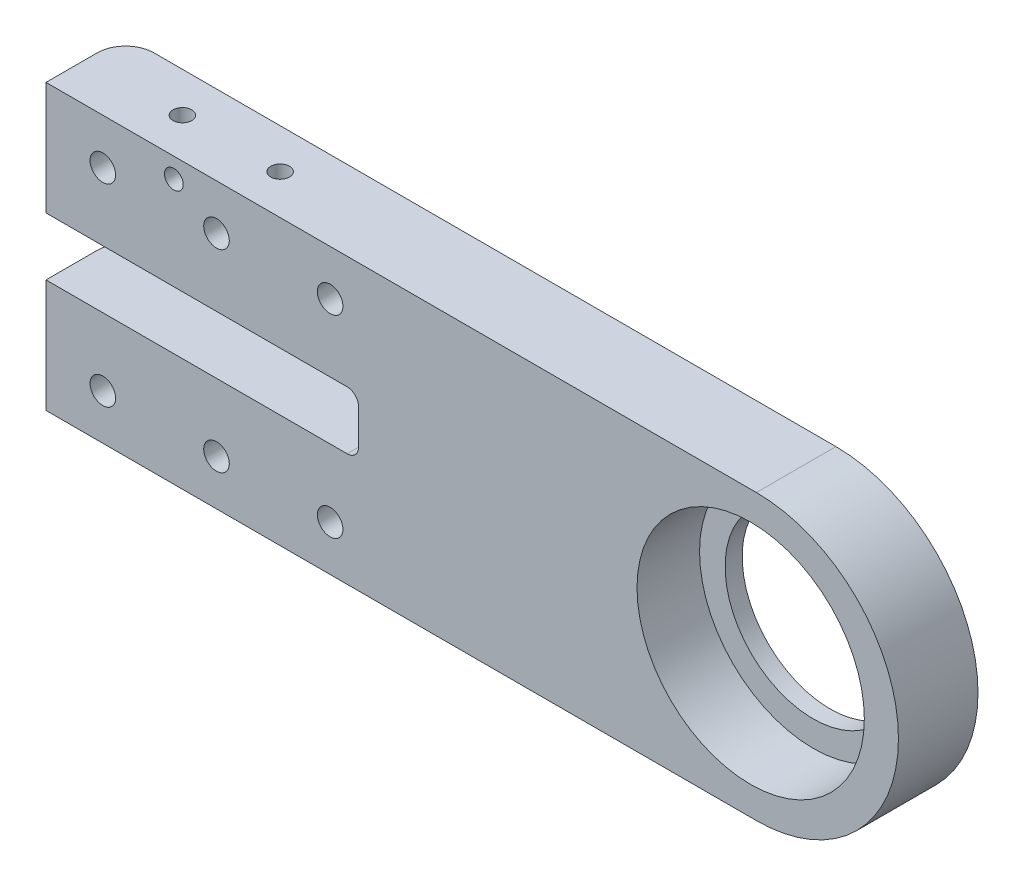
ISO-10303-21;
HEADER;
FILE_DESCRIPTION(('STEP AP214'),'2;1');
FILE_NAME('part.step','',(''),(''),'','','');
FILE_SCHEMA(('AUTOMOTIVE_DESIGN { 1 0 10303 214 1 1 1 1 }'));
ENDSEC;
DATA;
#1=APPLICATION_CONTEXT('core data for automotive mechanical design processes');
#2=APPLICATION_PROTOCOL_DEFINITION('international standard','automotive_design',2000,#1);
#3=PRODUCT_CONTEXT('',#1,'mechanical');
#4=PRODUCT('Part','Part','',(#3));
#5=PRODUCT_RELATED_PRODUCT_CATEGORY('part','',(#4));
#6=PRODUCT_DEFINITION_FORMATION('','',#4);
#7=PRODUCT_DEFINITION_CONTEXT('part definition',#1,'design');
#8=PRODUCT_DEFINITION('design','',#6,#7);
#9=PRODUCT_DEFINITION_SHAPE('','',#8);
#10=(LENGTH_UNIT() NAMED_UNIT(*) SI_UNIT(.MILLI.,.METRE.));
#11=(NAMED_UNIT(*) PLANE_ANGLE_UNIT() SI_UNIT($,.RADIAN.));
#12=(NAMED_UNIT(*) SI_UNIT($,.STERADIAN.) SOLID_ANGLE_UNIT());
#13=UNCERTAINTY_MEASURE_WITH_UNIT(LENGTH_MEASURE(1.E-05),#10,'distance_accuracy_value','');
#14=(GEOMETRIC_REPRESENTATION_CONTEXT(3) GLOBAL_UNCERTAINTY_ASSIGNED_CONTEXT((#13)) GLOBAL_UNIT_ASSIGNED_CONTEXT((#10,
#11,#12)) REPRESENTATION_CONTEXT('',''));
#15=CARTESIAN_POINT('',(0.,0.,0.));
#16=DIRECTION('',(0.,0.,1.));
#17=DIRECTION('',(1.,0.,0.));
#18=AXIS2_PLACEMENT_3D('',#15,#16,#17);
#19=CARTESIAN_POINT('',(0.,-50.,14.));
#20=DIRECTION('',(-1.,0.,0.));
#21=DIRECTION('',(0.,-1.,0.));
#22=AXIS2_PLACEMENT_3D('',#19,#20,#21);
#23=PLANE('',#22);
#24=DIRECTION('',(0.,0.,-1.));
#25=VECTOR('',#24,1.);
#26=CARTESIAN_POINT('',(0.,0.,14.));
#27=LINE('',#26,#25);
#28=CARTESIAN_POINT('',(0.,0.,14.));
#29=VERTEX_POINT('',#28);
#30=CARTESIAN_POINT('',(0.,0.,5.));
#31=VERTEX_POINT('',#30);
#32=EDGE_CURVE('E186',#29,#31,#27,.T.);
#33=ORIENTED_EDGE('',*,*,#32,.T.);
#34=DIRECTION('',(0.,1.,0.));
#35=VECTOR('',#34,1.);
#36=CARTESIAN_POINT('',(0.,-50.,5.));
#37=LINE('',#36,#35);
#38=CARTESIAN_POINT('',(0.,-19.8999999994651,5.));
#39=VERTEX_POINT('',#38);
#40=EDGE_CURVE('E45',#31,#39,#37,.F.);
#41=ORIENTED_EDGE('',*,*,#40,.T.);
#42=DIRECTION('',(0.,0.,1.));
#43=VECTOR('',#42,1.);
#44=CARTESIAN_POINT('',(0.,-19.8999999994651,0.));
#45=LINE('',#44,#43);
#46=CARTESIAN_POINT('',(0.,-19.8999999994651,14.));
#47=VERTEX_POINT('',#46);
#48=EDGE_CURVE('E137',#39,#47,#45,.T.);
#49=ORIENTED_EDGE('',*,*,#48,.T.);
#50=DIRECTION('',(0.,1.,0.));
#51=VECTOR('',#50,1.);
#52=CARTESIAN_POINT('',(0.,-50.,14.));
#53=LINE('',#52,#51);
#54=EDGE_CURVE('E158',#47,#29,#53,.T.);
#55=ORIENTED_EDGE('',*,*,#54,.T.);
#56=EDGE_LOOP('',(#33,#41,#49,#55));
#57=FACE_BOUND('',#56,.T.);
#58=ADVANCED_FACE('F36',(#57),#23,.T.);
#59=CARTESIAN_POINT('',(125.,-25.,14.));
#60=DIRECTION('',(0.,0.,-1.));
#61=DIRECTION('',(-1.,0.,0.));
#62=AXIS2_PLACEMENT_3D('',#59,#60,#61);
#63=CYLINDRICAL_SURFACE('',#62,25.);
#64=CARTESIAN_POINT('',(125.,-25.,0.));
#65=DIRECTION('',(0.,0.,-1.));
#66=DIRECTION('',(-1.,0.,0.));
#67=AXIS2_PLACEMENT_3D('',#64,#65,#66);
#68=CIRCLE('',#67,25.);
#69=CARTESIAN_POINT('',(125.,0.,0.));
#70=VERTEX_POINT('',#69);
#71=CARTESIAN_POINT('',(125.,-50.,0.));
#72=VERTEX_POINT('',#71);
#73=EDGE_CURVE('E170',#70,#72,#68,.T.);
#74=ORIENTED_EDGE('',*,*,#73,.F.);
#75=DIRECTION('',(0.,0.,-1.));
#76=VECTOR('',#75,1.);
#77=CARTESIAN_POINT('',(125.,0.,14.));
#78=LINE('',#77,#76);
#79=CARTESIAN_POINT('',(125.,0.,14.));
#80=VERTEX_POINT('',#79);
#81=EDGE_CURVE('E181',#80,#70,#78,.T.);
#82=ORIENTED_EDGE('',*,*,#81,.F.);
#83=CARTESIAN_POINT('',(125.,-25.,14.));
#84=DIRECTION('',(0.,0.,-1.));
#85=DIRECTION('',(-1.,0.,0.));
#86=AXIS2_PLACEMENT_3D('',#83,#84,#85);
#87=CIRCLE('',#86,25.);
#88=CARTESIAN_POINT('',(125.,-50.,14.));
#89=VERTEX_POINT('',#88);
#90=EDGE_CURVE('E180',#80,#89,#87,.T.);
#91=ORIENTED_EDGE('',*,*,#90,.T.);
#92=DIRECTION('',(0.,0.,-1.));
#93=VECTOR('',#92,1.);
#94=CARTESIAN_POINT('',(125.,-50.,14.));
#95=LINE('',#94,#93);
#96=EDGE_CURVE('E163',#89,#72,#95,.T.);
#97=ORIENTED_EDGE('',*,*,#96,.T.);
#98=EDGE_LOOP('',(#74,#82,#91,#97));
#99=FACE_BOUND('',#98,.T.);
#100=ADVANCED_FACE('F390',(#99),#63,.T.);
#101=CARTESIAN_POINT('',(0.,0.,14.));
#102=DIRECTION('',(0.,1.,0.));
#103=DIRECTION('',(0.,0.,1.));
#104=AXIS2_PLACEMENT_3D('',#101,#102,#103);
#105=PLANE('',#104);
#106=CARTESIAN_POINT('',(17.,0.,7.00000000000001));
#107=DIRECTION('',(0.,1.,0.));
#108=DIRECTION('',(0.,0.,1.));
#109=AXIS2_PLACEMENT_3D('',#106,#107,#108);
#110=CIRCLE('',#109,1.64999999999998);
#111=CARTESIAN_POINT('',(17.,0.,8.64999999999999));
#112=VERTEX_POINT('',#111);
#113=EDGE_CURVE('E295',#112,#112,#110,.T.);
#114=ORIENTED_EDGE('',*,*,#113,.F.);
#115=EDGE_LOOP('',(#114));
#116=FACE_BOUND('',#115,.T.);
#117=CARTESIAN_POINT('',(34.2,0.,7.00000000000001));
#118=DIRECTION('',(0.,1.,0.));
#119=DIRECTION('',(0.,0.,1.));
#120=AXIS2_PLACEMENT_3D('',#117,#118,#119);
#121=CIRCLE('',#120,1.64999999999998);
#122=CARTESIAN_POINT('',(34.2,0.,8.64999999999999));
#123=VERTEX_POINT('',#122);
#124=EDGE_CURVE('E294',#123,#123,#121,.T.);
#125=ORIENTED_EDGE('',*,*,#124,.F.);
#126=EDGE_LOOP('',(#125));
#127=FACE_BOUND('',#126,.T.);
#128=DIRECTION('',(1.,0.,0.));
#129=VECTOR('',#128,1.);
#130=CARTESIAN_POINT('',(0.,0.,0.));
#131=LINE('',#130,#129);
#132=CARTESIAN_POINT('',(5.,0.,0.));
#133=VERTEX_POINT('',#132);
#134=EDGE_CURVE('E178',#133,#70,#131,.T.);
#135=ORIENTED_EDGE('',*,*,#134,.F.);
#136=CARTESIAN_POINT('',(5.,0.,5.));
#137=DIRECTION('',(0.,1.,0.));
#138=DIRECTION('',(0.,0.,1.));
#139=AXIS2_PLACEMENT_3D('',#136,#137,#138);
#140=CIRCLE('',#139,5.);
#141=EDGE_CURVE('E59',#133,#31,#140,.T.);
#142=ORIENTED_EDGE('',*,*,#141,.T.);
#143=ORIENTED_EDGE('',*,*,#32,.F.);
#144=DIRECTION('',(1.,0.,0.));
#145=VECTOR('',#144,1.);
#146=CARTESIAN_POINT('',(0.,0.,14.));
#147=LINE('',#146,#145);
#148=EDGE_CURVE('E157',#29,#80,#147,.T.);
#149=ORIENTED_EDGE('',*,*,#148,.T.);
#150=ORIENTED_EDGE('',*,*,#81,.T.);
#151=EDGE_LOOP('',(#135,#142,#143,#149,#150));
#152=FACE_BOUND('',#151,.T.);
#153=ADVANCED_FACE('F395',(#116,#127,#152),#105,.T.);
#154=DIRECTION('',(0.,0.,1.));
#155=VECTOR('',#154,1.);
#156=CARTESIAN_POINT('',(0.,-30.0999999994651,0.));
#157=LINE('',#156,#155);
#158=CARTESIAN_POINT('',(0.,-30.0999999994651,5.));
#159=VERTEX_POINT('',#158);
#160=CARTESIAN_POINT('',(0.,-30.0999999994651,14.));
#161=VERTEX_POINT('',#160);
#162=EDGE_CURVE('E125',#159,#161,#157,.T.);
#163=ORIENTED_EDGE('',*,*,#162,.F.);
#164=DIRECTION('',(0.,1.,0.));
#165=VECTOR('',#164,1.);
#166=CARTESIAN_POINT('',(0.,-50.,5.));
#167=LINE('',#166,#165);
#168=CARTESIAN_POINT('',(0.,-50.,5.));
#169=VERTEX_POINT('',#168);
#170=EDGE_CURVE('E275',#159,#169,#167,.F.);
#171=ORIENTED_EDGE('',*,*,#170,.T.);
#172=DIRECTION('',(0.,0.,-1.));
#173=VECTOR('',#172,1.);
#174=CARTESIAN_POINT('',(0.,-50.,14.));
#175=LINE('',#174,#173);
#176=CARTESIAN_POINT('',(0.,-50.,14.));
#177=VERTEX_POINT('',#176);
#178=EDGE_CURVE('E155',#177,#169,#175,.T.);
#179=ORIENTED_EDGE('',*,*,#178,.F.);
#180=EDGE_CURVE('E145',#177,#161,#53,.T.);
#181=ORIENTED_EDGE('',*,*,#180,.T.);
#182=EDGE_LOOP('',(#163,#171,#179,#181));
#183=FACE_BOUND('',#182,.T.);
#184=ADVANCED_FACE('F153',(#183),#23,.T.);
#185=CARTESIAN_POINT('',(125.,-50.,14.));
#186=DIRECTION('',(0.,-1.,0.));
#187=DIRECTION('',(0.,0.,-1.));
#188=AXIS2_PLACEMENT_3D('',#185,#186,#187);
#189=PLANE('',#188);
#190=ORIENTED_EDGE('',*,*,#178,.T.);
#191=CARTESIAN_POINT('',(5.00000000000001,-50.,5.));
#192=DIRECTION('',(0.,-1.,0.));
#193=DIRECTION('',(0.,0.,-1.));
#194=AXIS2_PLACEMENT_3D('',#191,#192,#193);
#195=CIRCLE('',#194,5.);
#196=CARTESIAN_POINT('',(5.,-50.,0.));
#197=VERTEX_POINT('',#196);
#198=EDGE_CURVE('E278',#169,#197,#195,.T.);
#199=ORIENTED_EDGE('',*,*,#198,.T.);
#200=DIRECTION('',(-1.,0.,0.));
#201=VECTOR('',#200,1.);
#202=CARTESIAN_POINT('',(125.,-50.,0.));
#203=LINE('',#202,#201);
#204=EDGE_CURVE('E174',#72,#197,#203,.T.);
#205=ORIENTED_EDGE('',*,*,#204,.F.);
#206=ORIENTED_EDGE('',*,*,#96,.F.);
#207=DIRECTION('',(-1.,0.,0.));
#208=VECTOR('',#207,1.);
#209=CARTESIAN_POINT('',(125.,-50.,14.));
#210=LINE('',#209,#208);
#211=EDGE_CURVE('E166',#89,#177,#210,.T.);
#212=ORIENTED_EDGE('',*,*,#211,.T.);
#213=EDGE_LOOP('',(#190,#199,#205,#206,#212));
#214=FACE_BOUND('',#213,.T.);
#215=ADVANCED_FACE('F401',(#214),#189,.T.);
#216=CARTESIAN_POINT('',(125.,-25.,14.));
#217=DIRECTION('',(0.,0.,-1.));
#218=DIRECTION('',(-1.,0.,0.));
#219=AXIS2_PLACEMENT_3D('',#216,#217,#218);
#220=PLANE('',#219);
#221=CARTESIAN_POINT('',(123.999999994871,-24.9999999994651,14.));
#222=DIRECTION('',(0.,0.,1.));
#223=DIRECTION('',(1.,0.,0.));
#224=AXIS2_PLACEMENT_3D('',#221,#222,#223);
#225=CIRCLE('',#224,20.0000000051291);
#226=CARTESIAN_POINT('',(144.,-24.9999999994651,14.));
#227=VERTEX_POINT('',#226);
#228=EDGE_CURVE('E306',#227,#227,#225,.T.);
#229=ORIENTED_EDGE('',*,*,#228,.F.);
#230=EDGE_LOOP('',(#229));
#231=FACE_BOUND('',#230,.T.);
#232=CARTESIAN_POINT('',(22.5,-3.5,14.));
#233=DIRECTION('',(0.,0.,1.));
#234=DIRECTION('',(1.,0.,0.));
#235=AXIS2_PLACEMENT_3D('',#232,#233,#234);
#236=CIRCLE('',#235,1.64999999999998);
#237=CARTESIAN_POINT('',(24.15,-3.5,14.));
#238=VERTEX_POINT('',#237);
#239=EDGE_CURVE('E285',#238,#238,#236,.T.);
#240=ORIENTED_EDGE('',*,*,#239,.F.);
#241=EDGE_LOOP('',(#240));
#242=FACE_BOUND('',#241,.T.);
#243=CARTESIAN_POINT('',(10.,-8.,14.));
#244=DIRECTION('',(0.,0.,-1.));
#245=DIRECTION('',(-1.,0.,0.));
#246=AXIS2_PLACEMENT_3D('',#243,#244,#245);
#247=CIRCLE('',#246,2.24999999999997);
#248=CARTESIAN_POINT('',(7.75000000000003,-8.,14.));
#249=VERTEX_POINT('',#248);
#250=EDGE_CURVE('E312',#249,#249,#247,.T.);
#251=ORIENTED_EDGE('',*,*,#250,.T.);
#252=EDGE_LOOP('',(#251));
#253=FACE_BOUND('',#252,.T.);
#254=CARTESIAN_POINT('',(9.99999999999998,-42.,14.));
#255=DIRECTION('',(0.,0.,-1.));
#256=DIRECTION('',(-1.,0.,0.));
#257=AXIS2_PLACEMENT_3D('',#254,#255,#256);
#258=CIRCLE('',#257,2.24999999999997);
#259=CARTESIAN_POINT('',(7.75000000000002,-42.,14.));
#260=VERTEX_POINT('',#259);
#261=EDGE_CURVE('E325',#260,#260,#258,.T.);
#262=ORIENTED_EDGE('',*,*,#261,.T.);
#263=EDGE_LOOP('',(#262));
#264=FACE_BOUND('',#263,.T.);
#265=CARTESIAN_POINT('',(30.,-42.,14.));
#266=DIRECTION('',(0.,0.,-1.));
#267=DIRECTION('',(-1.,0.,0.));
#268=AXIS2_PLACEMENT_3D('',#265,#266,#267);
#269=CIRCLE('',#268,2.24999999999997);
#270=CARTESIAN_POINT('',(27.75,-42.,14.));
#271=VERTEX_POINT('',#270);
#272=EDGE_CURVE('E301',#271,#271,#269,.T.);
#273=ORIENTED_EDGE('',*,*,#272,.T.);
#274=EDGE_LOOP('',(#273));
#275=FACE_BOUND('',#274,.T.);
#276=CARTESIAN_POINT('',(30.,-8.,14.));
#277=DIRECTION('',(0.,0.,-1.));
#278=DIRECTION('',(-1.,0.,0.));
#279=AXIS2_PLACEMENT_3D('',#276,#277,#278);
#280=CIRCLE('',#279,2.24999999999996);
#281=CARTESIAN_POINT('',(27.75,-8.,14.));
#282=VERTEX_POINT('',#281);
#283=EDGE_CURVE('E297',#282,#282,#280,.T.);
#284=ORIENTED_EDGE('',*,*,#283,.T.);
#285=EDGE_LOOP('',(#284));
#286=FACE_BOUND('',#285,.T.);
#287=CARTESIAN_POINT('',(50.,-8.00000000000001,14.));
#288=DIRECTION('',(0.,0.,-1.));
#289=DIRECTION('',(-1.,0.,0.));
#290=AXIS2_PLACEMENT_3D('',#287,#288,#289);
#291=CIRCLE('',#290,2.24999999999997);
#292=CARTESIAN_POINT('',(47.75,-8.00000000000001,14.));
#293=VERTEX_POINT('',#292);
#294=EDGE_CURVE('E300',#293,#293,#291,.T.);
#295=ORIENTED_EDGE('',*,*,#294,.T.);
#296=EDGE_LOOP('',(#295));
#297=FACE_BOUND('',#296,.T.);
#298=CARTESIAN_POINT('',(50.,-42.,14.));
#299=DIRECTION('',(0.,0.,-1.));
#300=DIRECTION('',(-1.,0.,0.));
#301=AXIS2_PLACEMENT_3D('',#298,#299,#300);
#302=CIRCLE('',#301,2.24999999999997);
#303=CARTESIAN_POINT('',(47.75,-42.,14.));
#304=VERTEX_POINT('',#303);
#305=EDGE_CURVE('E151',#304,#304,#302,.T.);
#306=ORIENTED_EDGE('',*,*,#305,.T.);
#307=EDGE_LOOP('',(#306));
#308=FACE_BOUND('',#307,.T.);
#309=ORIENTED_EDGE('',*,*,#54,.F.);
#310=DIRECTION('',(-1.,0.,0.));
#311=VECTOR('',#310,1.);
#312=CARTESIAN_POINT('',(55.,-19.8999999994651,14.));
#313=LINE('',#312,#311);
#314=CARTESIAN_POINT('',(53.,-19.8999999994651,14.));
#315=VERTEX_POINT('',#314);
#316=EDGE_CURVE('E316',#315,#47,#313,.T.);
#317=ORIENTED_EDGE('',*,*,#316,.F.);
#318=CARTESIAN_POINT('',(53.,-21.8999999994651,14.));
#319=DIRECTION('',(0.,0.,-1.));
#320=DIRECTION('',(-1.,0.,0.));
#321=AXIS2_PLACEMENT_3D('',#318,#319,#320);
#322=CIRCLE('',#321,2.);
#323=CARTESIAN_POINT('',(55.,-21.8999999994651,14.));
#324=VERTEX_POINT('',#323);
#325=EDGE_CURVE('E254',#315,#324,#322,.T.);
#326=ORIENTED_EDGE('',*,*,#325,.T.);
#327=DIRECTION('',(0.,1.,0.));
#328=VECTOR('',#327,1.);
#329=CARTESIAN_POINT('',(55.,-30.0999999994651,14.));
#330=LINE('',#329,#328);
#331=CARTESIAN_POINT('',(55.,-28.0999999994651,14.));
#332=VERTEX_POINT('',#331);
#333=EDGE_CURVE('E150',#332,#324,#330,.T.);
#334=ORIENTED_EDGE('',*,*,#333,.F.);
#335=CARTESIAN_POINT('',(53.,-28.0999999994651,14.));
#336=DIRECTION('',(0.,0.,-1.));
#337=DIRECTION('',(-1.,0.,0.));
#338=AXIS2_PLACEMENT_3D('',#335,#336,#337);
#339=CIRCLE('',#338,2.);
#340=CARTESIAN_POINT('',(53.,-30.0999999994651,14.));
#341=VERTEX_POINT('',#340);
#342=EDGE_CURVE('E148',#332,#341,#339,.T.);
#343=ORIENTED_EDGE('',*,*,#342,.T.);
#344=DIRECTION('',(1.,0.,0.));
#345=VECTOR('',#344,1.);
#346=CARTESIAN_POINT('',(0.,-30.0999999994651,14.));
#347=LINE('',#346,#345);
#348=EDGE_CURVE('E130',#161,#341,#347,.T.);
#349=ORIENTED_EDGE('',*,*,#348,.F.);
#350=ORIENTED_EDGE('',*,*,#180,.F.);
#351=ORIENTED_EDGE('',*,*,#211,.F.);
#352=ORIENTED_EDGE('',*,*,#90,.F.);
#353=ORIENTED_EDGE('',*,*,#148,.F.);
#354=EDGE_LOOP('',(#309,#317,#326,#334,#343,#349,#350,#351,#352,#353));
#355=FACE_BOUND('',#354,.T.);
#356=ADVANCED_FACE('F143',(#231,#242,#253,#264,#275,#286,#297,#308,#355),#220,.F.);
#357=CARTESIAN_POINT('',(125.,-25.,0.));
#358=DIRECTION('',(0.,0.,-1.));
#359=DIRECTION('',(-1.,0.,0.));
#360=AXIS2_PLACEMENT_3D('',#357,#358,#359);
#361=PLANE('',#360);
#362=CARTESIAN_POINT('',(30.,-42.,0.));
#363=DIRECTION('',(0.,0.,-1.));
#364=DIRECTION('',(-1.,0.,0.));
#365=AXIS2_PLACEMENT_3D('',#362,#363,#364);
#366=CIRCLE('',#365,4.70000000001612);
#367=CARTESIAN_POINT('',(25.2999999999839,-42.,0.));
#368=VERTEX_POINT('',#367);
#369=EDGE_CURVE('E216',#368,#368,#366,.F.);
#370=ORIENTED_EDGE('',*,*,#369,.T.);
#371=EDGE_LOOP('',(#370));
#372=FACE_BOUND('',#371,.T.);
#373=CARTESIAN_POINT('',(9.99999999999998,-42.,0.));
#374=DIRECTION('',(0.,0.,-1.));
#375=DIRECTION('',(-1.,0.,0.));
#376=AXIS2_PLACEMENT_3D('',#373,#374,#375);
#377=CIRCLE('',#376,4.70000000001608);
#378=CARTESIAN_POINT('',(5.2999999999839,-42.,0.));
#379=VERTEX_POINT('',#378);
#380=EDGE_CURVE('E212',#379,#379,#377,.F.);
#381=ORIENTED_EDGE('',*,*,#380,.T.);
#382=EDGE_LOOP('',(#381));
#383=FACE_BOUND('',#382,.T.);
#384=CARTESIAN_POINT('',(50.,-42.,0.));
#385=DIRECTION('',(0.,0.,-1.));
#386=DIRECTION('',(-1.,0.,0.));
#387=AXIS2_PLACEMENT_3D('',#384,#385,#386);
#388=CIRCLE('',#387,4.70000000001608);
#389=CARTESIAN_POINT('',(45.2999999999839,-42.,0.));
#390=VERTEX_POINT('',#389);
#391=EDGE_CURVE('E208',#390,#390,#388,.F.);
#392=ORIENTED_EDGE('',*,*,#391,.T.);
#393=EDGE_LOOP('',(#392));
#394=FACE_BOUND('',#393,.T.);
#395=CARTESIAN_POINT('',(30.,-8.,0.));
#396=DIRECTION('',(0.,0.,-1.));
#397=DIRECTION('',(-1.,0.,0.));
#398=AXIS2_PLACEMENT_3D('',#395,#396,#397);
#399=CIRCLE('',#398,4.70000000001607);
#400=CARTESIAN_POINT('',(25.2999999999839,-8.,0.));
#401=VERTEX_POINT('',#400);
#402=EDGE_CURVE('E204',#401,#401,#399,.F.);
#403=ORIENTED_EDGE('',*,*,#402,.T.);
#404=EDGE_LOOP('',(#403));
#405=FACE_BOUND('',#404,.T.);
#406=CARTESIAN_POINT('',(10.,-8.,0.));
#407=DIRECTION('',(0.,0.,-1.));
#408=DIRECTION('',(-1.,0.,0.));
#409=AXIS2_PLACEMENT_3D('',#406,#407,#408);
#410=CIRCLE('',#409,4.70000000001612);
#411=CARTESIAN_POINT('',(5.29999999998388,-8.,0.));
#412=VERTEX_POINT('',#411);
#413=EDGE_CURVE('E200',#412,#412,#410,.F.);
#414=ORIENTED_EDGE('',*,*,#413,.T.);
#415=EDGE_LOOP('',(#414));
#416=FACE_BOUND('',#415,.T.);
#417=CARTESIAN_POINT('',(50.,-8.00000000000001,0.));
#418=DIRECTION('',(0.,0.,-1.));
#419=DIRECTION('',(-1.,0.,0.));
#420=AXIS2_PLACEMENT_3D('',#417,#418,#419);
#421=CIRCLE('',#420,4.70000000001608);
#422=CARTESIAN_POINT('',(45.2999999999839,-8.00000000000001,0.));
#423=VERTEX_POINT('',#422);
#424=EDGE_CURVE('E196',#423,#423,#421,.F.);
#425=ORIENTED_EDGE('',*,*,#424,.T.);
#426=EDGE_LOOP('',(#425));
#427=FACE_BOUND('',#426,.T.);
#428=CARTESIAN_POINT('',(123.999999994871,-24.9999999994651,0.));
#429=DIRECTION('',(0.,0.,1.));
#430=DIRECTION('',(1.,0.,0.));
#431=AXIS2_PLACEMENT_3D('',#428,#429,#430);
#432=CIRCLE('',#431,15.500000004746);
#433=CARTESIAN_POINT('',(139.499999999617,-24.9999999994651,0.));
#434=VERTEX_POINT('',#433);
#435=EDGE_CURVE('E341',#434,#434,#432,.T.);
#436=ORIENTED_EDGE('',*,*,#435,.T.);
#437=EDGE_LOOP('',(#436));
#438=FACE_BOUND('',#437,.T.);
#439=CARTESIAN_POINT('',(22.5,-3.5,0.));
#440=DIRECTION('',(0.,0.,1.));
#441=DIRECTION('',(1.,0.,0.));
#442=AXIS2_PLACEMENT_3D('',#439,#440,#441);
#443=CIRCLE('',#442,1.64999999999998);
#444=CARTESIAN_POINT('',(24.15,-3.5,0.));
#445=VERTEX_POINT('',#444);
#446=EDGE_CURVE('E287',#445,#445,#443,.T.);
#447=ORIENTED_EDGE('',*,*,#446,.T.);
#448=EDGE_LOOP('',(#447));
#449=FACE_BOUND('',#448,.T.);
#450=ORIENTED_EDGE('',*,*,#204,.T.);
#451=DIRECTION('',(0.,1.,0.));
#452=VECTOR('',#451,1.);
#453=CARTESIAN_POINT('',(5.,-25.,0.));
#454=LINE('',#453,#452);
#455=CARTESIAN_POINT('',(5.,-30.0999999994651,0.));
#456=VERTEX_POINT('',#455);
#457=EDGE_CURVE('E269',#197,#456,#454,.T.);
#458=ORIENTED_EDGE('',*,*,#457,.T.);
#459=DIRECTION('',(1.,0.,0.));
#460=VECTOR('',#459,1.);
#461=CARTESIAN_POINT('',(0.,-30.0999999994651,0.));
#462=LINE('',#461,#460);
#463=CARTESIAN_POINT('',(53.,-30.0999999994651,0.));
#464=VERTEX_POINT('',#463);
#465=EDGE_CURVE('E347',#456,#464,#462,.T.);
#466=ORIENTED_EDGE('',*,*,#465,.T.);
#467=CARTESIAN_POINT('',(53.,-28.0999999994651,0.));
#468=DIRECTION('',(0.,0.,-1.));
#469=DIRECTION('',(-1.,0.,0.));
#470=AXIS2_PLACEMENT_3D('',#467,#468,#469);
#471=CIRCLE('',#470,2.);
#472=CARTESIAN_POINT('',(55.,-28.0999999994651,0.));
#473=VERTEX_POINT('',#472);
#474=EDGE_CURVE('E262',#464,#473,#471,.F.);
#475=ORIENTED_EDGE('',*,*,#474,.T.);
#476=DIRECTION('',(0.,1.,0.));
#477=VECTOR('',#476,1.);
#478=CARTESIAN_POINT('',(55.,-30.0999999994651,0.));
#479=LINE('',#478,#477);
#480=CARTESIAN_POINT('',(55.,-21.8999999994651,0.));
#481=VERTEX_POINT('',#480);
#482=EDGE_CURVE('E344',#473,#481,#479,.T.);
#483=ORIENTED_EDGE('',*,*,#482,.T.);
#484=CARTESIAN_POINT('',(53.,-21.8999999994651,0.));
#485=DIRECTION('',(0.,0.,-1.));
#486=DIRECTION('',(-1.,0.,0.));
#487=AXIS2_PLACEMENT_3D('',#484,#485,#486);
#488=CIRCLE('',#487,2.);
#489=CARTESIAN_POINT('',(53.,-19.8999999994651,0.));
#490=VERTEX_POINT('',#489);
#491=EDGE_CURVE('E257',#481,#490,#488,.F.);
#492=ORIENTED_EDGE('',*,*,#491,.T.);
#493=DIRECTION('',(-1.,0.,0.));
#494=VECTOR('',#493,1.);
#495=CARTESIAN_POINT('',(55.,-19.8999999994651,0.));
#496=LINE('',#495,#494);
#497=CARTESIAN_POINT('',(5.,-19.8999999994651,0.));
#498=VERTEX_POINT('',#497);
#499=EDGE_CURVE('E138',#490,#498,#496,.T.);
#500=ORIENTED_EDGE('',*,*,#499,.T.);
#501=DIRECTION('',(0.,1.,0.));
#502=VECTOR('',#501,1.);
#503=CARTESIAN_POINT('',(5.,-25.,0.));
#504=LINE('',#503,#502);
#505=EDGE_CURVE('E265',#498,#133,#504,.T.);
#506=ORIENTED_EDGE('',*,*,#505,.T.);
#507=ORIENTED_EDGE('',*,*,#134,.T.);
#508=ORIENTED_EDGE('',*,*,#73,.T.);
#509=EDGE_LOOP('',(#450,#458,#466,#475,#483,#492,#500,#506,#507,#508));
#510=FACE_BOUND('',#509,.T.);
#511=ADVANCED_FACE('F413',(#372,#383,#394,#405,#416,#427,#438,#449,#510),#361,.T.);
#512=CARTESIAN_POINT('',(55.,-19.8999999994651,0.));
#513=DIRECTION('',(0.,1.,0.));
#514=DIRECTION('',(-1.,0.,0.));
#515=AXIS2_PLACEMENT_3D('',#512,#513,#514);
#516=PLANE('',#515);
#517=CARTESIAN_POINT('',(17.,-19.8999999994651,7.00000000000001));
#518=DIRECTION('',(0.,1.,0.));
#519=DIRECTION('',(-1.,0.,0.));
#520=AXIS2_PLACEMENT_3D('',#517,#518,#519);
#521=CIRCLE('',#520,1.64999999999998);
#522=CARTESIAN_POINT('',(15.35,-19.8999999994651,7.00000000000001));
#523=VERTEX_POINT('',#522);
#524=EDGE_CURVE('E291',#523,#523,#521,.T.);
#525=ORIENTED_EDGE('',*,*,#524,.T.);
#526=EDGE_LOOP('',(#525));
#527=FACE_BOUND('',#526,.T.);
#528=CARTESIAN_POINT('',(34.2,-19.8999999994651,7.00000000000001));
#529=DIRECTION('',(0.,1.,0.));
#530=DIRECTION('',(-1.,0.,0.));
#531=AXIS2_PLACEMENT_3D('',#528,#529,#530);
#532=CIRCLE('',#531,1.64999999999998);
#533=CARTESIAN_POINT('',(32.55,-19.8999999994651,7.00000000000001));
#534=VERTEX_POINT('',#533);
#535=EDGE_CURVE('E288',#534,#534,#532,.T.);
#536=ORIENTED_EDGE('',*,*,#535,.T.);
#537=EDGE_LOOP('',(#536));
#538=FACE_BOUND('',#537,.T.);
#539=ORIENTED_EDGE('',*,*,#48,.F.);
#540=CARTESIAN_POINT('',(5.,-19.8999999994651,5.));
#541=DIRECTION('',(0.,1.,0.));
#542=DIRECTION('',(-1.,0.,0.));
#543=AXIS2_PLACEMENT_3D('',#540,#541,#542);
#544=CIRCLE('',#543,5.);
#545=EDGE_CURVE('E11',#39,#498,#544,.F.);
#546=ORIENTED_EDGE('',*,*,#545,.T.);
#547=ORIENTED_EDGE('',*,*,#499,.F.);
#548=DIRECTION('',(0.,0.,1.));
#549=VECTOR('',#548,1.);
#550=CARTESIAN_POINT('',(53.,-19.8999999994651,14.));
#551=LINE('',#550,#549);
#552=EDGE_CURVE('E240',#490,#315,#551,.T.);
#553=ORIENTED_EDGE('',*,*,#552,.T.);
#554=ORIENTED_EDGE('',*,*,#316,.T.);
#555=EDGE_LOOP('',(#539,#546,#547,#553,#554));
#556=FACE_BOUND('',#555,.T.);
#557=ADVANCED_FACE('F416',(#527,#538,#556),#516,.F.);
#558=CARTESIAN_POINT('',(55.,-30.0999999994651,0.));
#559=DIRECTION('',(1.,0.,0.));
#560=DIRECTION('',(0.,0.,-1.));
#561=AXIS2_PLACEMENT_3D('',#558,#559,#560);
#562=PLANE('',#561);
#563=ORIENTED_EDGE('',*,*,#333,.T.);
#564=DIRECTION('',(0.,0.,1.));
#565=VECTOR('',#564,1.);
#566=CARTESIAN_POINT('',(55.,-21.8999999994651,0.));
#567=LINE('',#566,#565);
#568=EDGE_CURVE('E248',#324,#481,#567,.F.);
#569=ORIENTED_EDGE('',*,*,#568,.T.);
#570=ORIENTED_EDGE('',*,*,#482,.F.);
#571=DIRECTION('',(0.,0.,1.));
#572=VECTOR('',#571,1.);
#573=CARTESIAN_POINT('',(55.,-28.0999999994651,14.));
#574=LINE('',#573,#572);
#575=EDGE_CURVE('E244',#473,#332,#574,.T.);
#576=ORIENTED_EDGE('',*,*,#575,.T.);
#577=EDGE_LOOP('',(#563,#569,#570,#576));
#578=FACE_BOUND('',#577,.T.);
#579=ADVANCED_FACE('F423',(#578),#562,.F.);
#580=CARTESIAN_POINT('',(0.,-30.0999999994651,0.));
#581=DIRECTION('',(0.,-1.,0.));
#582=DIRECTION('',(0.,0.,-1.));
#583=AXIS2_PLACEMENT_3D('',#580,#581,#582);
#584=PLANE('',#583);
#585=ORIENTED_EDGE('',*,*,#465,.F.);
#586=CARTESIAN_POINT('',(5.,-30.0999999994651,5.));
#587=DIRECTION('',(0.,-1.,0.));
#588=DIRECTION('',(0.,0.,-1.));
#589=AXIS2_PLACEMENT_3D('',#586,#587,#588);
#590=CIRCLE('',#589,5.);
#591=EDGE_CURVE('E132',#456,#159,#590,.F.);
#592=ORIENTED_EDGE('',*,*,#591,.T.);
#593=ORIENTED_EDGE('',*,*,#162,.T.);
#594=ORIENTED_EDGE('',*,*,#348,.T.);
#595=DIRECTION('',(0.,0.,1.));
#596=VECTOR('',#595,1.);
#597=CARTESIAN_POINT('',(53.,-30.0999999994651,0.));
#598=LINE('',#597,#596);
#599=EDGE_CURVE('E251',#341,#464,#598,.F.);
#600=ORIENTED_EDGE('',*,*,#599,.T.);
#601=EDGE_LOOP('',(#585,#592,#593,#594,#600));
#602=FACE_BOUND('',#601,.T.);
#603=ADVANCED_FACE('F128',(#602),#584,.F.);
#604=CARTESIAN_POINT('',(50.,-42.,0.));
#605=DIRECTION('',(0.,0.,-1.));
#606=DIRECTION('',(-1.,0.,0.));
#607=AXIS2_PLACEMENT_3D('',#604,#605,#606);
#608=CYLINDRICAL_SURFACE('',#607,2.24999999999997);
#609=CARTESIAN_POINT('',(50.,-42.,2.4499999999024));
#610=DIRECTION('',(0.,0.,-1.));
#611=DIRECTION('',(-1.,0.,0.));
#612=AXIS2_PLACEMENT_3D('',#609,#610,#611);
#613=CIRCLE('',#612,2.24999999999997);
#614=CARTESIAN_POINT('',(47.75,-42.,2.4499999999024));
#615=VERTEX_POINT('',#614);
#616=EDGE_CURVE('E224',#615,#615,#613,.T.);
#617=ORIENTED_EDGE('',*,*,#616,.T.);
#618=EDGE_LOOP('',(#617));
#619=FACE_BOUND('',#618,.T.);
#620=ORIENTED_EDGE('',*,*,#305,.F.);
#621=EDGE_LOOP('',(#620));
#622=FACE_BOUND('',#621,.T.);
#623=ADVANCED_FACE('F377',(#619,#622),#608,.F.);
#624=CARTESIAN_POINT('',(50.,-8.00000000000001,0.));
#625=DIRECTION('',(0.,0.,-1.));
#626=DIRECTION('',(-1.,0.,0.));
#627=AXIS2_PLACEMENT_3D('',#624,#625,#626);
#628=CYLINDRICAL_SURFACE('',#627,2.24999999999997);
#629=CARTESIAN_POINT('',(50.,-8.00000000000001,2.4499999999024));
#630=DIRECTION('',(0.,0.,-1.));
#631=DIRECTION('',(-1.,0.,0.));
#632=AXIS2_PLACEMENT_3D('',#629,#630,#631);
#633=CIRCLE('',#632,2.24999999999997);
#634=CARTESIAN_POINT('',(47.75,-8.00000000000001,2.4499999999024));
#635=VERTEX_POINT('',#634);
#636=EDGE_CURVE('E236',#635,#635,#633,.T.);
#637=ORIENTED_EDGE('',*,*,#636,.T.);
#638=EDGE_LOOP('',(#637));
#639=FACE_BOUND('',#638,.T.);
#640=ORIENTED_EDGE('',*,*,#294,.F.);
#641=EDGE_LOOP('',(#640));
#642=FACE_BOUND('',#641,.T.);
#643=ADVANCED_FACE('F374',(#639,#642),#628,.F.);
#644=CARTESIAN_POINT('',(30.,-8.,0.));
#645=DIRECTION('',(0.,0.,-1.));
#646=DIRECTION('',(-1.,0.,0.));
#647=AXIS2_PLACEMENT_3D('',#644,#645,#646);
#648=CYLINDRICAL_SURFACE('',#647,2.24999999999996);
#649=CARTESIAN_POINT('',(30.,-8.,2.44999999990241));
#650=DIRECTION('',(0.,0.,-1.));
#651=DIRECTION('',(-1.,0.,0.));
#652=AXIS2_PLACEMENT_3D('',#649,#650,#651);
#653=CIRCLE('',#652,2.24999999999996);
#654=CARTESIAN_POINT('',(27.75,-8.,2.44999999990241));
#655=VERTEX_POINT('',#654);
#656=EDGE_CURVE('E228',#655,#655,#653,.T.);
#657=ORIENTED_EDGE('',*,*,#656,.T.);
#658=EDGE_LOOP('',(#657));
#659=FACE_BOUND('',#658,.T.);
#660=ORIENTED_EDGE('',*,*,#283,.F.);
#661=EDGE_LOOP('',(#660));
#662=FACE_BOUND('',#661,.T.);
#663=ADVANCED_FACE('F376',(#659,#662),#648,.F.);
#664=CARTESIAN_POINT('',(30.,-42.,0.));
#665=DIRECTION('',(0.,0.,-1.));
#666=DIRECTION('',(-1.,0.,0.));
#667=AXIS2_PLACEMENT_3D('',#664,#665,#666);
#668=CYLINDRICAL_SURFACE('',#667,2.24999999999997);
#669=CARTESIAN_POINT('',(30.,-42.,2.44999999990245));
#670=DIRECTION('',(0.,0.,-1.));
#671=DIRECTION('',(-1.,0.,0.));
#672=AXIS2_PLACEMENT_3D('',#669,#670,#671);
#673=CIRCLE('',#672,2.24999999999997);
#674=CARTESIAN_POINT('',(27.75,-42.,2.44999999990245));
#675=VERTEX_POINT('',#674);
#676=EDGE_CURVE('E185',#675,#675,#673,.T.);
#677=ORIENTED_EDGE('',*,*,#676,.T.);
#678=EDGE_LOOP('',(#677));
#679=FACE_BOUND('',#678,.T.);
#680=ORIENTED_EDGE('',*,*,#272,.F.);
#681=EDGE_LOOP('',(#680));
#682=FACE_BOUND('',#681,.T.);
#683=ADVANCED_FACE('F384',(#679,#682),#668,.F.);
#684=CARTESIAN_POINT('',(9.99999999999998,-42.,0.));
#685=DIRECTION('',(0.,0.,-1.));
#686=DIRECTION('',(-1.,0.,0.));
#687=AXIS2_PLACEMENT_3D('',#684,#685,#686);
#688=CYLINDRICAL_SURFACE('',#687,2.24999999999997);
#689=CARTESIAN_POINT('',(9.99999999999998,-42.,2.4499999999024));
#690=DIRECTION('',(0.,0.,-1.));
#691=DIRECTION('',(-1.,0.,0.));
#692=AXIS2_PLACEMENT_3D('',#689,#690,#691);
#693=CIRCLE('',#692,2.24999999999997);
#694=CARTESIAN_POINT('',(7.75000000000002,-42.,2.4499999999024));
#695=VERTEX_POINT('',#694);
#696=EDGE_CURVE('E220',#695,#695,#693,.T.);
#697=ORIENTED_EDGE('',*,*,#696,.T.);
#698=EDGE_LOOP('',(#697));
#699=FACE_BOUND('',#698,.T.);
#700=ORIENTED_EDGE('',*,*,#261,.F.);
#701=EDGE_LOOP('',(#700));
#702=FACE_BOUND('',#701,.T.);
#703=ADVANCED_FACE('F501',(#699,#702),#688,.F.);
#704=CARTESIAN_POINT('',(10.,-8.,0.));
#705=DIRECTION('',(0.,0.,-1.));
#706=DIRECTION('',(-1.,0.,0.));
#707=AXIS2_PLACEMENT_3D('',#704,#705,#706);
#708=CYLINDRICAL_SURFACE('',#707,2.24999999999997);
#709=CARTESIAN_POINT('',(10.,-8.,2.44999999990245));
#710=DIRECTION('',(0.,0.,-1.));
#711=DIRECTION('',(-1.,0.,0.));
#712=AXIS2_PLACEMENT_3D('',#709,#710,#711);
#713=CIRCLE('',#712,2.24999999999997);
#714=CARTESIAN_POINT('',(7.75000000000003,-8.,2.44999999990245));
#715=VERTEX_POINT('',#714);
#716=EDGE_CURVE('E232',#715,#715,#713,.T.);
#717=ORIENTED_EDGE('',*,*,#716,.T.);
#718=EDGE_LOOP('',(#717));
#719=FACE_BOUND('',#718,.T.);
#720=ORIENTED_EDGE('',*,*,#250,.F.);
#721=EDGE_LOOP('',(#720));
#722=FACE_BOUND('',#721,.T.);
#723=ADVANCED_FACE('F511',(#719,#722),#708,.F.);
#724=CARTESIAN_POINT('',(22.5,-3.5,14.));
#725=DIRECTION('',(0.,0.,1.));
#726=DIRECTION('',(1.,0.,0.));
#727=AXIS2_PLACEMENT_3D('',#724,#725,#726);
#728=CYLINDRICAL_SURFACE('',#727,1.64999999999998);
#729=ORIENTED_EDGE('',*,*,#446,.F.);
#730=EDGE_LOOP('',(#729));
#731=FACE_BOUND('',#730,.T.);
#732=ORIENTED_EDGE('',*,*,#239,.T.);
#733=EDGE_LOOP('',(#732));
#734=FACE_BOUND('',#733,.T.);
#735=ADVANCED_FACE('F517',(#731,#734),#728,.F.);
#736=CARTESIAN_POINT('',(34.2,0.,7.00000000000001));
#737=DIRECTION('',(0.,1.,0.));
#738=DIRECTION('',(0.,0.,1.));
#739=AXIS2_PLACEMENT_3D('',#736,#737,#738);
#740=CYLINDRICAL_SURFACE('',#739,1.64999999999998);
#741=ORIENTED_EDGE('',*,*,#535,.F.);
#742=EDGE_LOOP('',(#741));
#743=FACE_BOUND('',#742,.T.);
#744=ORIENTED_EDGE('',*,*,#124,.T.);
#745=EDGE_LOOP('',(#744));
#746=FACE_BOUND('',#745,.T.);
#747=ADVANCED_FACE('F521',(#743,#746),#740,.F.);
#748=CARTESIAN_POINT('',(17.,0.,7.00000000000001));
#749=DIRECTION('',(0.,1.,0.));
#750=DIRECTION('',(0.,0.,1.));
#751=AXIS2_PLACEMENT_3D('',#748,#749,#750);
#752=CYLINDRICAL_SURFACE('',#751,1.64999999999998);
#753=ORIENTED_EDGE('',*,*,#524,.F.);
#754=EDGE_LOOP('',(#753));
#755=FACE_BOUND('',#754,.T.);
#756=ORIENTED_EDGE('',*,*,#113,.T.);
#757=EDGE_LOOP('',(#756));
#758=FACE_BOUND('',#757,.T.);
#759=ADVANCED_FACE('F525',(#755,#758),#752,.F.);
#760=CARTESIAN_POINT('',(123.999999994871,-24.9999999994651,14.));
#761=DIRECTION('',(0.,0.,1.));
#762=DIRECTION('',(1.,0.,0.));
#763=AXIS2_PLACEMENT_3D('',#760,#761,#762);
#764=CYLINDRICAL_SURFACE('',#763,15.500000004746);
#765=ORIENTED_EDGE('',*,*,#435,.F.);
#766=EDGE_LOOP('',(#765));
#767=FACE_BOUND('',#766,.T.);
#768=CARTESIAN_POINT('',(123.999999994871,-24.9999999994651,3.));
#769=DIRECTION('',(0.,0.,1.));
#770=DIRECTION('',(1.,0.,0.));
#771=AXIS2_PLACEMENT_3D('',#768,#769,#770);
#772=CIRCLE('',#771,15.500000004746);
#773=CARTESIAN_POINT('',(139.499999999617,-24.9999999994651,3.));
#774=VERTEX_POINT('',#773);
#775=EDGE_CURVE('E305',#774,#774,#772,.T.);
#776=ORIENTED_EDGE('',*,*,#775,.T.);
#777=EDGE_LOOP('',(#776));
#778=FACE_BOUND('',#777,.T.);
#779=ADVANCED_FACE('F529',(#767,#778),#764,.F.);
#780=CARTESIAN_POINT('',(139.499999999617,-24.9999999994651,3.));
#781=DIRECTION('',(0.,0.,-1.));
#782=DIRECTION('',(-1.,0.,0.));
#783=AXIS2_PLACEMENT_3D('',#780,#781,#782);
#784=PLANE('',#783);
#785=ORIENTED_EDGE('',*,*,#775,.F.);
#786=EDGE_LOOP('',(#785));
#787=FACE_BOUND('',#786,.T.);
#788=CARTESIAN_POINT('',(123.999999994871,-24.9999999994651,3.));
#789=DIRECTION('',(0.,0.,1.));
#790=DIRECTION('',(1.,0.,0.));
#791=AXIS2_PLACEMENT_3D('',#788,#789,#790);
#792=CIRCLE('',#791,20.0000000051291);
#793=CARTESIAN_POINT('',(144.,-24.9999999994651,3.));
#794=VERTEX_POINT('',#793);
#795=EDGE_CURVE('E303',#794,#794,#792,.T.);
#796=ORIENTED_EDGE('',*,*,#795,.T.);
#797=EDGE_LOOP('',(#796));
#798=FACE_BOUND('',#797,.T.);
#799=ADVANCED_FACE('F492',(#787,#798),#784,.F.);
#800=CARTESIAN_POINT('',(123.999999994871,-24.9999999994651,14.));
#801=DIRECTION('',(0.,0.,1.));
#802=DIRECTION('',(1.,0.,0.));
#803=AXIS2_PLACEMENT_3D('',#800,#801,#802);
#804=CYLINDRICAL_SURFACE('',#803,20.0000000051291);
#805=ORIENTED_EDGE('',*,*,#795,.F.);
#806=EDGE_LOOP('',(#805));
#807=FACE_BOUND('',#806,.T.);
#808=ORIENTED_EDGE('',*,*,#228,.T.);
#809=EDGE_LOOP('',(#808));
#810=FACE_BOUND('',#809,.T.);
#811=ADVANCED_FACE('F487',(#807,#810),#804,.F.);
#812=CARTESIAN_POINT('',(30.,-42.,2.44999999990245));
#813=DIRECTION('',(0.,0.,-1.));
#814=DIRECTION('',(-1.,0.,0.));
#815=AXIS2_PLACEMENT_3D('',#812,#813,#814);
#816=CONICAL_SURFACE('',#815,2.24999999999997,0.785398163420654);
#817=ORIENTED_EDGE('',*,*,#369,.F.);
#818=EDGE_LOOP('',(#817));
#819=FACE_BOUND('',#818,.T.);
#820=ORIENTED_EDGE('',*,*,#676,.F.);
#821=EDGE_LOOP('',(#820));
#822=FACE_BOUND('',#821,.T.);
#823=ADVANCED_FACE('F484',(#819,#822),#816,.F.);
#824=CARTESIAN_POINT('',(9.99999999999998,-42.,2.4499999999024));
#825=DIRECTION('',(0.,0.,-1.));
#826=DIRECTION('',(-1.,0.,0.));
#827=AXIS2_PLACEMENT_3D('',#824,#825,#826);
#828=CONICAL_SURFACE('',#827,2.24999999999997,0.785398163420654);
#829=ORIENTED_EDGE('',*,*,#380,.F.);
#830=EDGE_LOOP('',(#829));
#831=FACE_BOUND('',#830,.T.);
#832=ORIENTED_EDGE('',*,*,#696,.F.);
#833=EDGE_LOOP('',(#832));
#834=FACE_BOUND('',#833,.T.);
#835=ADVANCED_FACE('F480',(#831,#834),#828,.F.);
#836=CARTESIAN_POINT('',(50.,-42.,2.4499999999024));
#837=DIRECTION('',(0.,0.,-1.));
#838=DIRECTION('',(-1.,0.,0.));
#839=AXIS2_PLACEMENT_3D('',#836,#837,#838);
#840=CONICAL_SURFACE('',#839,2.24999999999997,0.785398163420654);
#841=ORIENTED_EDGE('',*,*,#391,.F.);
#842=EDGE_LOOP('',(#841));
#843=FACE_BOUND('',#842,.T.);
#844=ORIENTED_EDGE('',*,*,#616,.F.);
#845=EDGE_LOOP('',(#844));
#846=FACE_BOUND('',#845,.T.);
#847=ADVANCED_FACE('F476',(#843,#846),#840,.F.);
#848=CARTESIAN_POINT('',(30.,-8.,2.44999999990241));
#849=DIRECTION('',(0.,0.,-1.));
#850=DIRECTION('',(-1.,0.,0.));
#851=AXIS2_PLACEMENT_3D('',#848,#849,#850);
#852=CONICAL_SURFACE('',#851,2.24999999999996,0.785398163420652);
#853=ORIENTED_EDGE('',*,*,#402,.F.);
#854=EDGE_LOOP('',(#853));
#855=FACE_BOUND('',#854,.T.);
#856=ORIENTED_EDGE('',*,*,#656,.F.);
#857=EDGE_LOOP('',(#856));
#858=FACE_BOUND('',#857,.T.);
#859=ADVANCED_FACE('F472',(#855,#858),#852,.F.);
#860=CARTESIAN_POINT('',(10.,-8.,2.44999999990245));
#861=DIRECTION('',(0.,0.,-1.));
#862=DIRECTION('',(-1.,0.,0.));
#863=AXIS2_PLACEMENT_3D('',#860,#861,#862);
#864=CONICAL_SURFACE('',#863,2.24999999999997,0.785398163420654);
#865=ORIENTED_EDGE('',*,*,#413,.F.);
#866=EDGE_LOOP('',(#865));
#867=FACE_BOUND('',#866,.T.);
#868=ORIENTED_EDGE('',*,*,#716,.F.);
#869=EDGE_LOOP('',(#868));
#870=FACE_BOUND('',#869,.T.);
#871=ADVANCED_FACE('F468',(#867,#870),#864,.F.);
#872=CARTESIAN_POINT('',(50.,-8.00000000000001,2.4499999999024));
#873=DIRECTION('',(0.,0.,-1.));
#874=DIRECTION('',(-1.,0.,0.));
#875=AXIS2_PLACEMENT_3D('',#872,#873,#874);
#876=CONICAL_SURFACE('',#875,2.24999999999997,0.785398163420654);
#877=ORIENTED_EDGE('',*,*,#424,.F.);
#878=EDGE_LOOP('',(#877));
#879=FACE_BOUND('',#878,.T.);
#880=ORIENTED_EDGE('',*,*,#636,.F.);
#881=EDGE_LOOP('',(#880));
#882=FACE_BOUND('',#881,.T.);
#883=ADVANCED_FACE('F463',(#879,#882),#876,.F.);
#884=CARTESIAN_POINT('',(53.,-21.8999999994651,0.));
#885=DIRECTION('',(0.,0.,-1.));
#886=DIRECTION('',(-1.,0.,0.));
#887=AXIS2_PLACEMENT_3D('',#884,#885,#886);
#888=CYLINDRICAL_SURFACE('',#887,2.);
#889=ORIENTED_EDGE('',*,*,#491,.F.);
#890=ORIENTED_EDGE('',*,*,#568,.F.);
#891=ORIENTED_EDGE('',*,*,#325,.F.);
#892=ORIENTED_EDGE('',*,*,#552,.F.);
#893=EDGE_LOOP('',(#889,#890,#891,#892));
#894=FACE_BOUND('',#893,.T.);
#895=ADVANCED_FACE('F453',(#894),#888,.F.);
#896=CARTESIAN_POINT('',(53.,-28.0999999994651,0.));
#897=DIRECTION('',(0.,0.,-1.));
#898=DIRECTION('',(-1.,0.,0.));
#899=AXIS2_PLACEMENT_3D('',#896,#897,#898);
#900=CYLINDRICAL_SURFACE('',#899,2.);
#901=ORIENTED_EDGE('',*,*,#474,.F.);
#902=ORIENTED_EDGE('',*,*,#599,.F.);
#903=ORIENTED_EDGE('',*,*,#342,.F.);
#904=ORIENTED_EDGE('',*,*,#575,.F.);
#905=EDGE_LOOP('',(#901,#902,#903,#904));
#906=FACE_BOUND('',#905,.T.);
#907=ADVANCED_FACE('F456',(#906),#900,.F.);
#908=CARTESIAN_POINT('',(5.,-25.,5.));
#909=DIRECTION('',(0.,1.,0.));
#910=DIRECTION('',(-1.,0.,0.));
#911=AXIS2_PLACEMENT_3D('',#908,#909,#910);
#912=CYLINDRICAL_SURFACE('',#911,5.);
#913=ORIENTED_EDGE('',*,*,#198,.F.);
#914=ORIENTED_EDGE('',*,*,#170,.F.);
#915=ORIENTED_EDGE('',*,*,#591,.F.);
#916=ORIENTED_EDGE('',*,*,#457,.F.);
#917=EDGE_LOOP('',(#913,#914,#915,#916));
#918=FACE_BOUND('',#917,.T.);
#919=ADVANCED_FACE('F446',(#918),#912,.T.);
#920=CARTESIAN_POINT('',(5.,-25.,5.));
#921=DIRECTION('',(0.,1.,0.));
#922=DIRECTION('',(-1.,0.,0.));
#923=AXIS2_PLACEMENT_3D('',#920,#921,#922);
#924=CYLINDRICAL_SURFACE('',#923,5.);
#925=ORIENTED_EDGE('',*,*,#545,.F.);
#926=ORIENTED_EDGE('',*,*,#40,.F.);
#927=ORIENTED_EDGE('',*,*,#141,.F.);
#928=ORIENTED_EDGE('',*,*,#505,.F.);
#929=EDGE_LOOP('',(#925,#926,#927,#928));
#930=FACE_BOUND('',#929,.T.);
#931=ADVANCED_FACE('F38',(#930),#924,.T.);
#932=CLOSED_SHELL('',(#58,#100,#153,#184,#215,#356,#511,#557,#579,#603,#623,#643,#663,#683,#703,
#723,#735,#747,#759,#779,#799,#811,#823,#835,#847,#859,#871,#883,#895,#907,#919,#931));
#933=MANIFOLD_SOLID_BREP('B2',#932);
#934=ADVANCED_BREP_SHAPE_REPRESENTATION('',(#18,#933),#14);
#935=SHAPE_DEFINITION_REPRESENTATION(#9,#934);
ENDSEC;
END-ISO-10303-21;
